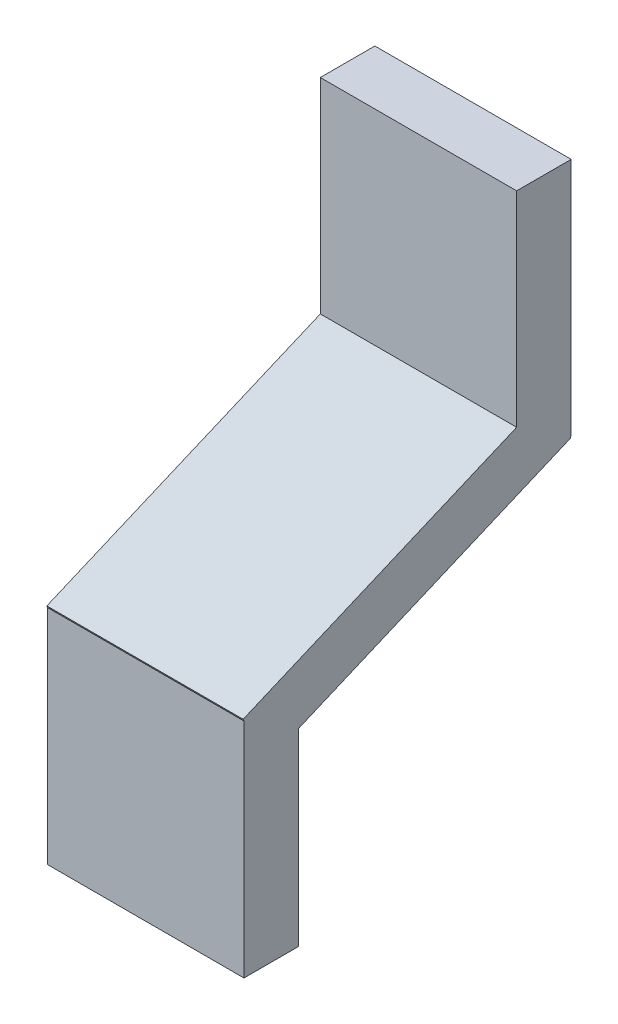
ISO-10303-21;
HEADER;
FILE_DESCRIPTION(('STEP AP214'),'2;1');
FILE_NAME('part.step','',(''),(''),'','','');
FILE_SCHEMA(('AUTOMOTIVE_DESIGN { 1 0 10303 214 1 1 1 1 }'));
ENDSEC;
DATA;
#1=APPLICATION_CONTEXT('core data for automotive mechanical design processes');
#2=APPLICATION_PROTOCOL_DEFINITION('international standard','automotive_design',2000,#1);
#3=PRODUCT_CONTEXT('',#1,'mechanical');
#4=PRODUCT('Part','Part','',(#3));
#5=PRODUCT_RELATED_PRODUCT_CATEGORY('part','',(#4));
#6=PRODUCT_DEFINITION_FORMATION('','',#4);
#7=PRODUCT_DEFINITION_CONTEXT('part definition',#1,'design');
#8=PRODUCT_DEFINITION('design','',#6,#7);
#9=PRODUCT_DEFINITION_SHAPE('','',#8);
#10=(LENGTH_UNIT() NAMED_UNIT(*) SI_UNIT(.MILLI.,.METRE.));
#11=(NAMED_UNIT(*) PLANE_ANGLE_UNIT() SI_UNIT($,.RADIAN.));
#12=(NAMED_UNIT(*) SI_UNIT($,.STERADIAN.) SOLID_ANGLE_UNIT());
#13=UNCERTAINTY_MEASURE_WITH_UNIT(LENGTH_MEASURE(1.E-05),#10,'distance_accuracy_value','');
#14=(GEOMETRIC_REPRESENTATION_CONTEXT(3) GLOBAL_UNCERTAINTY_ASSIGNED_CONTEXT((#13)) GLOBAL_UNIT_ASSIGNED_CONTEXT((#10,
#11,#12)) REPRESENTATION_CONTEXT('',''));
#15=CARTESIAN_POINT('',(0.,0.,0.));
#16=DIRECTION('',(0.,0.,1.));
#17=DIRECTION('',(1.,0.,0.));
#18=AXIS2_PLACEMENT_3D('',#15,#16,#17);
#19=CARTESIAN_POINT('',(9.82,11.,0.5));
#20=DIRECTION('',(0.,0.,1.));
#21=DIRECTION('',(1.,0.,0.));
#22=AXIS2_PLACEMENT_3D('',#19,#20,#21);
#23=PLANE('',#22);
#24=DIRECTION('',(1.,0.,0.));
#25=VECTOR('',#24,1.);
#26=CARTESIAN_POINT('',(9.82,11.3461054439247,0.500000000000314));
#27=LINE('',#26,#25);
#28=CARTESIAN_POINT('',(10.180000014305,11.3461054439242,0.500000000000105));
#29=VERTEX_POINT('',#28);
#30=CARTESIAN_POINT('',(9.82,11.3461054439243,0.500000000000105));
#31=VERTEX_POINT('',#30);
#32=EDGE_CURVE('E148',#29,#31,#27,.F.);
#33=ORIENTED_EDGE('',*,*,#32,.F.);
#34=DIRECTION('',(0.,1.,0.));
#35=VECTOR('',#34,1.);
#36=CARTESIAN_POINT('',(10.180000014305,11.65,0.5));
#37=LINE('',#36,#35);
#38=CARTESIAN_POINT('',(10.180000014305,11.,0.5));
#39=VERTEX_POINT('',#38);
#40=EDGE_CURVE('E154',#39,#29,#37,.T.);
#41=ORIENTED_EDGE('',*,*,#40,.F.);
#42=DIRECTION('',(1.,0.,0.));
#43=VECTOR('',#42,1.);
#44=CARTESIAN_POINT('',(9.82,11.,0.5));
#45=LINE('',#44,#43);
#46=CARTESIAN_POINT('',(9.82,11.,0.5));
#47=VERTEX_POINT('',#46);
#48=EDGE_CURVE('E135',#39,#47,#45,.F.);
#49=ORIENTED_EDGE('',*,*,#48,.T.);
#50=DIRECTION('',(0.,1.,0.));
#51=VECTOR('',#50,1.);
#52=CARTESIAN_POINT('',(9.82,11.65,0.5));
#53=LINE('',#52,#51);
#54=EDGE_CURVE('E182',#47,#31,#53,.T.);
#55=ORIENTED_EDGE('',*,*,#54,.T.);
#56=EDGE_LOOP('',(#33,#41,#49,#55));
#57=FACE_BOUND('',#56,.T.);
#58=ADVANCED_FACE('F17',(#57),#23,.F.);
#59=CARTESIAN_POINT('',(9.82,11.557949520001,0.0009268707435867));
#60=DIRECTION('',(0.,-0.920504786278108,-0.390731286742046));
#61=DIRECTION('',(0.,0.390731286742046,-0.920504786278108));
#62=AXIS2_PLACEMENT_3D('',#59,#60,#61);
#63=PLANE('',#62);
#64=DIRECTION('',(0.,0.39073128674346,-0.920504786277508));
#65=VECTOR('',#64,1.);
#66=CARTESIAN_POINT('',(10.180000014305,11.346105443924,0.5));
#67=LINE('',#66,#65);
#68=CARTESIAN_POINT('',(10.180000014305,11.557949520001,0.000926870743687995));
#69=VERTEX_POINT('',#68);
#70=EDGE_CURVE('E151',#29,#69,#67,.T.);
#71=ORIENTED_EDGE('',*,*,#70,.F.);
#72=ORIENTED_EDGE('',*,*,#32,.T.);
#73=DIRECTION('',(0.,0.39073128674346,-0.920504786277508));
#74=VECTOR('',#73,1.);
#75=CARTESIAN_POINT('',(9.82,11.346105443924,0.5));
#76=LINE('',#75,#74);
#77=CARTESIAN_POINT('',(9.82,11.557949520001,0.000926870743697318));
#78=VERTEX_POINT('',#77);
#79=EDGE_CURVE('E178',#31,#78,#76,.T.);
#80=ORIENTED_EDGE('',*,*,#79,.T.);
#81=DIRECTION('',(1.,0.,0.));
#82=VECTOR('',#81,1.);
#83=CARTESIAN_POINT('',(9.82,11.557949520001,0.000926870743744277));
#84=LINE('',#83,#82);
#85=EDGE_CURVE('E145',#78,#69,#84,.T.);
#86=ORIENTED_EDGE('',*,*,#85,.T.);
#87=EDGE_LOOP('',(#71,#72,#80,#86));
#88=FACE_BOUND('',#87,.T.);
#89=ADVANCED_FACE('F242',(#88),#63,.T.);
#90=CARTESIAN_POINT('',(9.82,11.65,0.04));
#91=DIRECTION('',(0.,-0.390731286742046,0.920504786278108));
#92=DIRECTION('',(0.,-0.920504786278108,-0.390731286742046));
#93=AXIS2_PLACEMENT_3D('',#90,#91,#92);
#94=PLANE('',#93);
#95=DIRECTION('',(0.,0.920504786259231,0.390731286786518));
#96=VECTOR('',#95,1.);
#97=CARTESIAN_POINT('',(9.82,11.557949520001,0.00092687074366));
#98=LINE('',#97,#96);
#99=CARTESIAN_POINT('',(9.82,11.56,0.001797248280528));
#100=VERTEX_POINT('',#99);
#101=EDGE_CURVE('E123',#78,#100,#98,.T.);
#102=ORIENTED_EDGE('',*,*,#101,.T.);
#103=DIRECTION('',(1.,0.,0.));
#104=VECTOR('',#103,1.);
#105=CARTESIAN_POINT('',(9.82,11.56,0.001797248280528));
#106=LINE('',#105,#104);
#107=CARTESIAN_POINT('',(10.180000014305,11.56,0.001797248280528));
#108=VERTEX_POINT('',#107);
#109=EDGE_CURVE('E97',#100,#108,#106,.T.);
#110=ORIENTED_EDGE('',*,*,#109,.T.);
#111=DIRECTION('',(0.,0.920504786259231,0.390731286786518));
#112=VECTOR('',#111,1.);
#113=CARTESIAN_POINT('',(10.180000014305,11.557949520001,0.00092687074366));
#114=LINE('',#113,#112);
#115=EDGE_CURVE('E153',#69,#108,#114,.T.);
#116=ORIENTED_EDGE('',*,*,#115,.F.);
#117=ORIENTED_EDGE('',*,*,#85,.F.);
#118=EDGE_LOOP('',(#102,#110,#116,#117));
#119=FACE_BOUND('',#118,.T.);
#120=ADVANCED_FACE('F243',(#119),#94,.F.);
#121=CARTESIAN_POINT('',(9.82,11.56,0.));
#122=DIRECTION('',(0.,1.,0.));
#123=DIRECTION('',(0.,0.,1.));
#124=AXIS2_PLACEMENT_3D('',#121,#122,#123);
#125=PLANE('',#124);
#126=ORIENTED_EDGE('',*,*,#109,.F.);
#127=DIRECTION('',(0.,0.,1.));
#128=VECTOR('',#127,1.);
#129=CARTESIAN_POINT('',(9.82,11.56,0.));
#130=LINE('',#129,#128);
#131=CARTESIAN_POINT('',(9.82,11.56,0.));
#132=VERTEX_POINT('',#131);
#133=EDGE_CURVE('E20',#100,#132,#130,.F.);
#134=ORIENTED_EDGE('',*,*,#133,.T.);
#135=DIRECTION('',(1.,0.,0.));
#136=VECTOR('',#135,1.);
#137=CARTESIAN_POINT('',(9.82,11.56,0.));
#138=LINE('',#137,#136);
#139=CARTESIAN_POINT('',(10.180000014305,11.56,0.));
#140=VERTEX_POINT('',#139);
#141=EDGE_CURVE('E104',#132,#140,#138,.T.);
#142=ORIENTED_EDGE('',*,*,#141,.T.);
#143=DIRECTION('',(0.,0.,-1.));
#144=VECTOR('',#143,1.);
#145=CARTESIAN_POINT('',(10.180000014305,11.56,0.04));
#146=LINE('',#145,#144);
#147=EDGE_CURVE('E194',#108,#140,#146,.T.);
#148=ORIENTED_EDGE('',*,*,#147,.F.);
#149=EDGE_LOOP('',(#126,#134,#142,#148));
#150=FACE_BOUND('',#149,.T.);
#151=ADVANCED_FACE('F122',(#150),#125,.F.);
#152=CARTESIAN_POINT('',(9.82,11.56,0.));
#153=DIRECTION('',(0.,0.,1.));
#154=DIRECTION('',(1.,0.,0.));
#155=AXIS2_PLACEMENT_3D('',#152,#153,#154);
#156=PLANE('',#155);
#157=ORIENTED_EDGE('',*,*,#141,.F.);
#158=DIRECTION('',(0.,1.,0.));
#159=VECTOR('',#158,1.);
#160=CARTESIAN_POINT('',(9.82,11.65,0.));
#161=LINE('',#160,#159);
#162=CARTESIAN_POINT('',(9.82,11.999999997616,0.));
#163=VERTEX_POINT('',#162);
#164=EDGE_CURVE('E108',#132,#163,#161,.T.);
#165=ORIENTED_EDGE('',*,*,#164,.T.);
#166=DIRECTION('',(1.,0.,0.));
#167=VECTOR('',#166,1.);
#168=CARTESIAN_POINT('',(9.82,11.999999997616,0.));
#169=LINE('',#168,#167);
#170=CARTESIAN_POINT('',(10.180000014305,11.999999997616,0.));
#171=VERTEX_POINT('',#170);
#172=EDGE_CURVE('E110',#171,#163,#169,.F.);
#173=ORIENTED_EDGE('',*,*,#172,.F.);
#174=DIRECTION('',(0.,1.,0.));
#175=VECTOR('',#174,1.);
#176=CARTESIAN_POINT('',(10.180000014305,11.65,0.));
#177=LINE('',#176,#175);
#178=EDGE_CURVE('E109',#140,#171,#177,.T.);
#179=ORIENTED_EDGE('',*,*,#178,.F.);
#180=EDGE_LOOP('',(#157,#165,#173,#179));
#181=FACE_BOUND('',#180,.T.);
#182=ADVANCED_FACE('F106',(#181),#156,.F.);
#183=CARTESIAN_POINT('',(9.82,11.999999997616,0.));
#184=DIRECTION('',(0.,1.,0.));
#185=DIRECTION('',(0.,0.,1.));
#186=AXIS2_PLACEMENT_3D('',#183,#184,#185);
#187=PLANE('',#186);
#188=ORIENTED_EDGE('',*,*,#172,.T.);
#189=DIRECTION('',(0.,0.,-1.));
#190=VECTOR('',#189,1.);
#191=CARTESIAN_POINT('',(9.82,11.999999997616,0.04));
#192=LINE('',#191,#190);
#193=CARTESIAN_POINT('',(9.82,11.999999997616,0.10000000149));
#194=VERTEX_POINT('',#193);
#195=EDGE_CURVE('E120',#163,#194,#192,.F.);
#196=ORIENTED_EDGE('',*,*,#195,.T.);
#197=DIRECTION('',(1.,0.,0.));
#198=VECTOR('',#197,1.);
#199=CARTESIAN_POINT('',(9.82,11.999999997616,0.10000000149));
#200=LINE('',#199,#198);
#201=CARTESIAN_POINT('',(10.180000014305,11.999999997616,0.10000000149));
#202=VERTEX_POINT('',#201);
#203=EDGE_CURVE('E181',#202,#194,#200,.F.);
#204=ORIENTED_EDGE('',*,*,#203,.F.);
#205=DIRECTION('',(0.,0.,-1.));
#206=VECTOR('',#205,1.);
#207=CARTESIAN_POINT('',(10.180000014305,11.999999997616,0.04));
#208=LINE('',#207,#206);
#209=EDGE_CURVE('E140',#171,#202,#208,.F.);
#210=ORIENTED_EDGE('',*,*,#209,.F.);
#211=EDGE_LOOP('',(#188,#196,#204,#210));
#212=FACE_BOUND('',#211,.T.);
#213=ADVANCED_FACE('F271',(#212),#187,.T.);
#214=CARTESIAN_POINT('',(9.82,11.,0.60000000149));
#215=DIRECTION('',(0.,0.,1.));
#216=DIRECTION('',(1.,0.,0.));
#217=AXIS2_PLACEMENT_3D('',#214,#215,#216);
#218=PLANE('',#217);
#219=DIRECTION('',(0.,1.,0.));
#220=VECTOR('',#219,1.);
#221=CARTESIAN_POINT('',(10.180000014305,11.65,0.60000000149));
#222=LINE('',#221,#220);
#223=CARTESIAN_POINT('',(10.180000014305,11.408101447657,0.600000001490072));
#224=VERTEX_POINT('',#223);
#225=CARTESIAN_POINT('',(10.180000014305,11.,0.60000000149));
#226=VERTEX_POINT('',#225);
#227=EDGE_CURVE('E168',#224,#226,#222,.F.);
#228=ORIENTED_EDGE('',*,*,#227,.F.);
#229=DIRECTION('',(1.,0.,0.));
#230=VECTOR('',#229,1.);
#231=CARTESIAN_POINT('',(9.82,11.4081014476569,0.600000001490144));
#232=LINE('',#231,#230);
#233=CARTESIAN_POINT('',(9.82,11.408101447657,0.600000001490072));
#234=VERTEX_POINT('',#233);
#235=EDGE_CURVE('E124',#234,#224,#232,.T.);
#236=ORIENTED_EDGE('',*,*,#235,.F.);
#237=DIRECTION('',(0.,1.,0.));
#238=VECTOR('',#237,1.);
#239=CARTESIAN_POINT('',(9.82,11.65,0.60000000149));
#240=LINE('',#239,#238);
#241=CARTESIAN_POINT('',(9.82,11.,0.60000000149));
#242=VERTEX_POINT('',#241);
#243=EDGE_CURVE('E192',#234,#242,#240,.F.);
#244=ORIENTED_EDGE('',*,*,#243,.T.);
#245=DIRECTION('',(1.,0.,0.));
#246=VECTOR('',#245,1.);
#247=CARTESIAN_POINT('',(9.82,11.,0.60000000149));
#248=LINE('',#247,#246);
#249=EDGE_CURVE('E127',#242,#226,#248,.T.);
#250=ORIENTED_EDGE('',*,*,#249,.T.);
#251=EDGE_LOOP('',(#228,#236,#244,#250));
#252=FACE_BOUND('',#251,.T.);
#253=ADVANCED_FACE('F232',(#252),#218,.T.);
#254=CARTESIAN_POINT('',(9.82,11.,0.5));
#255=DIRECTION('',(0.,1.,0.));
#256=DIRECTION('',(0.,0.,1.));
#257=AXIS2_PLACEMENT_3D('',#254,#255,#256);
#258=PLANE('',#257);
#259=DIRECTION('',(0.,0.,-1.));
#260=VECTOR('',#259,1.);
#261=CARTESIAN_POINT('',(9.82,11.,0.04));
#262=LINE('',#261,#260);
#263=EDGE_CURVE('E187',#242,#47,#262,.T.);
#264=ORIENTED_EDGE('',*,*,#263,.T.);
#265=ORIENTED_EDGE('',*,*,#48,.F.);
#266=DIRECTION('',(0.,0.,-1.));
#267=VECTOR('',#266,1.);
#268=CARTESIAN_POINT('',(10.180000014305,11.,0.04));
#269=LINE('',#268,#267);
#270=EDGE_CURVE('E164',#226,#39,#269,.T.);
#271=ORIENTED_EDGE('',*,*,#270,.F.);
#272=ORIENTED_EDGE('',*,*,#249,.F.);
#273=EDGE_LOOP('',(#264,#265,#271,#272));
#274=FACE_BOUND('',#273,.T.);
#275=ADVANCED_FACE('F235',(#274),#258,.F.);
#276=CARTESIAN_POINT('',(9.82,11.411653909498,0.601507932798));
#277=DIRECTION('',(0.,-0.390731286742046,0.920504786278108));
#278=DIRECTION('',(0.,-0.920504786278108,-0.390731286742046));
#279=AXIS2_PLACEMENT_3D('',#276,#277,#278);
#280=PLANE('',#279);
#281=ORIENTED_EDGE('',*,*,#235,.T.);
#282=DIRECTION('',(0.,-0.920504786262243,-0.390731286779422));
#283=VECTOR('',#282,1.);
#284=CARTESIAN_POINT('',(10.180000014305,11.411653909498,0.601507932798));
#285=LINE('',#284,#283);
#286=CARTESIAN_POINT('',(10.180000014305,11.4116539094979,0.601507932797974));
#287=VERTEX_POINT('',#286);
#288=EDGE_CURVE('E227',#287,#224,#285,.T.);
#289=ORIENTED_EDGE('',*,*,#288,.F.);
#290=DIRECTION('',(1.,0.,0.));
#291=VECTOR('',#290,1.);
#292=CARTESIAN_POINT('',(9.82,11.4116539094978,0.601507932797897));
#293=LINE('',#292,#291);
#294=CARTESIAN_POINT('',(9.82,11.4116539094979,0.601507932797974));
#295=VERTEX_POINT('',#294);
#296=EDGE_CURVE('E167',#287,#295,#293,.F.);
#297=ORIENTED_EDGE('',*,*,#296,.T.);
#298=DIRECTION('',(0.,-0.920504786262243,-0.390731286779422));
#299=VECTOR('',#298,1.);
#300=CARTESIAN_POINT('',(9.82,11.411653909498,0.601507932798));
#301=LINE('',#300,#299);
#302=EDGE_CURVE('E175',#295,#234,#301,.T.);
#303=ORIENTED_EDGE('',*,*,#302,.T.);
#304=EDGE_LOOP('',(#281,#289,#297,#303));
#305=FACE_BOUND('',#304,.T.);
#306=ADVANCED_FACE('F210',(#305),#280,.T.);
#307=CARTESIAN_POINT('',(9.82,11.65,0.04));
#308=DIRECTION('',(1.,0.,0.));
#309=DIRECTION('',(0.,0.,-1.));
#310=AXIS2_PLACEMENT_3D('',#307,#308,#309);
#311=PLANE('',#310);
#312=ORIENTED_EDGE('',*,*,#54,.F.);
#313=ORIENTED_EDGE('',*,*,#263,.F.);
#314=ORIENTED_EDGE('',*,*,#243,.F.);
#315=ORIENTED_EDGE('',*,*,#302,.F.);
#316=DIRECTION('',(0.,0.390731286742046,-0.920504786278108));
#317=VECTOR('',#316,1.);
#318=CARTESIAN_POINT('',(9.82,11.65,0.04));
#319=LINE('',#318,#317);
#320=CARTESIAN_POINT('',(9.82,11.624531498221,0.100000001490019));
#321=VERTEX_POINT('',#320);
#322=EDGE_CURVE('E216',#295,#321,#319,.T.);
#323=ORIENTED_EDGE('',*,*,#322,.T.);
#324=DIRECTION('',(0.,1.,0.));
#325=VECTOR('',#324,1.);
#326=CARTESIAN_POINT('',(9.82,11.56,0.10000000149));
#327=LINE('',#326,#325);
#328=EDGE_CURVE('E161',#194,#321,#327,.F.);
#329=ORIENTED_EDGE('',*,*,#328,.F.);
#330=ORIENTED_EDGE('',*,*,#195,.F.);
#331=ORIENTED_EDGE('',*,*,#164,.F.);
#332=ORIENTED_EDGE('',*,*,#133,.F.);
#333=ORIENTED_EDGE('',*,*,#101,.F.);
#334=ORIENTED_EDGE('',*,*,#79,.F.);
#335=EDGE_LOOP('',(#312,#313,#314,#315,#323,#329,#330,#331,#332,#333,#334));
#336=FACE_BOUND('',#335,.T.);
#337=ADVANCED_FACE('F115',(#336),#311,.F.);
#338=CARTESIAN_POINT('',(9.82,11.56,0.10000000149));
#339=DIRECTION('',(0.,0.,1.));
#340=DIRECTION('',(1.,0.,0.));
#341=AXIS2_PLACEMENT_3D('',#338,#339,#340);
#342=PLANE('',#341);
#343=ORIENTED_EDGE('',*,*,#328,.T.);
#344=DIRECTION('',(1.,0.,0.));
#345=VECTOR('',#344,1.);
#346=CARTESIAN_POINT('',(9.82,11.6245314982212,0.100000001490075));
#347=LINE('',#346,#345);
#348=CARTESIAN_POINT('',(10.180000014305,11.624531498221,0.100000001490019));
#349=VERTEX_POINT('',#348);
#350=EDGE_CURVE('E26',#321,#349,#347,.T.);
#351=ORIENTED_EDGE('',*,*,#350,.T.);
#352=DIRECTION('',(0.,1.,0.));
#353=VECTOR('',#352,1.);
#354=CARTESIAN_POINT('',(10.180000014305,11.65,0.10000000149));
#355=LINE('',#354,#353);
#356=EDGE_CURVE('E34',#202,#349,#355,.F.);
#357=ORIENTED_EDGE('',*,*,#356,.F.);
#358=ORIENTED_EDGE('',*,*,#203,.T.);
#359=EDGE_LOOP('',(#343,#351,#357,#358));
#360=FACE_BOUND('',#359,.T.);
#361=ADVANCED_FACE('F257',(#360),#342,.T.);
#362=CARTESIAN_POINT('',(10.180000014305,11.65,0.04));
#363=DIRECTION('',(1.,0.,0.));
#364=DIRECTION('',(0.,0.,-1.));
#365=AXIS2_PLACEMENT_3D('',#362,#363,#364);
#366=PLANE('',#365);
#367=ORIENTED_EDGE('',*,*,#227,.T.);
#368=ORIENTED_EDGE('',*,*,#270,.T.);
#369=ORIENTED_EDGE('',*,*,#40,.T.);
#370=ORIENTED_EDGE('',*,*,#70,.T.);
#371=ORIENTED_EDGE('',*,*,#115,.T.);
#372=ORIENTED_EDGE('',*,*,#147,.T.);
#373=ORIENTED_EDGE('',*,*,#178,.T.);
#374=ORIENTED_EDGE('',*,*,#209,.T.);
#375=ORIENTED_EDGE('',*,*,#356,.T.);
#376=DIRECTION('',(0.,0.390731286742046,-0.920504786278108));
#377=VECTOR('',#376,1.);
#378=CARTESIAN_POINT('',(10.180000014305,11.65,0.04));
#379=LINE('',#378,#377);
#380=EDGE_CURVE('E11',#349,#287,#379,.F.);
#381=ORIENTED_EDGE('',*,*,#380,.T.);
#382=ORIENTED_EDGE('',*,*,#288,.T.);
#383=EDGE_LOOP('',(#367,#368,#369,#370,#371,#372,#373,#374,#375,#381,#382));
#384=FACE_BOUND('',#383,.T.);
#385=ADVANCED_FACE('F230',(#384),#366,.T.);
#386=CARTESIAN_POINT('',(9.82,11.65,0.04));
#387=DIRECTION('',(0.,-0.920504786278108,-0.390731286742046));
#388=DIRECTION('',(0.,0.390731286742046,-0.920504786278108));
#389=AXIS2_PLACEMENT_3D('',#386,#387,#388);
#390=PLANE('',#389);
#391=ORIENTED_EDGE('',*,*,#350,.F.);
#392=ORIENTED_EDGE('',*,*,#322,.F.);
#393=ORIENTED_EDGE('',*,*,#296,.F.);
#394=ORIENTED_EDGE('',*,*,#380,.F.);
#395=EDGE_LOOP('',(#391,#392,#393,#394));
#396=FACE_BOUND('',#395,.T.);
#397=ADVANCED_FACE('F220',(#396),#390,.F.);
#398=CLOSED_SHELL('',(#58,#89,#120,#151,#182,#213,#253,#275,#306,#337,#361,#385,#397));
#399=MANIFOLD_SOLID_BREP('B1',#398);
#400=ADVANCED_BREP_SHAPE_REPRESENTATION('',(#18,#399),#14);
#401=SHAPE_DEFINITION_REPRESENTATION(#9,#400);
ENDSEC;
END-ISO-10303-21;
